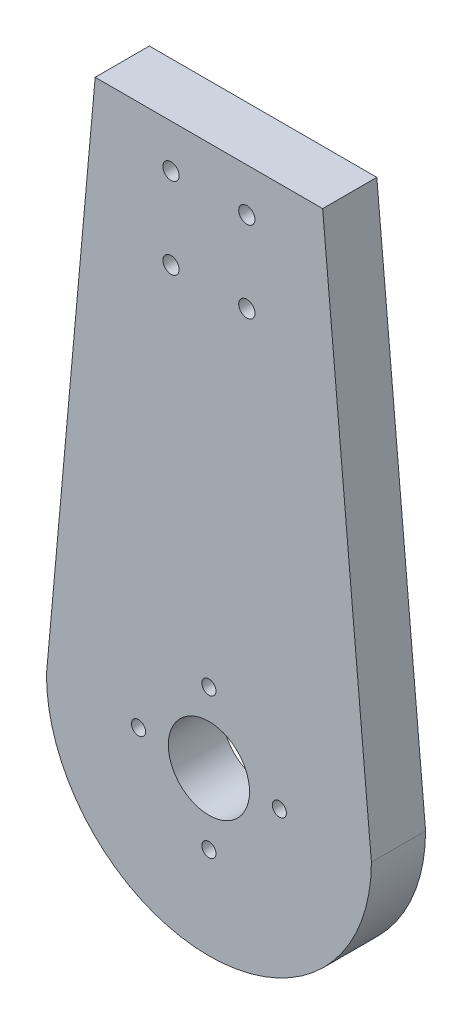
ISO-10303-21;
HEADER;
FILE_DESCRIPTION(('STEP AP214'),'2;1');
FILE_NAME('part.step','',(''),(''),'','','');
FILE_SCHEMA(('AUTOMOTIVE_DESIGN { 1 0 10303 214 1 1 1 1 }'));
ENDSEC;
DATA;
#1=APPLICATION_CONTEXT('core data for automotive mechanical design processes');
#2=APPLICATION_PROTOCOL_DEFINITION('international standard','automotive_design',2000,#1);
#3=PRODUCT_CONTEXT('',#1,'mechanical');
#4=PRODUCT('Part','Part','',(#3));
#5=PRODUCT_RELATED_PRODUCT_CATEGORY('part','',(#4));
#6=PRODUCT_DEFINITION_FORMATION('','',#4);
#7=PRODUCT_DEFINITION_CONTEXT('part definition',#1,'design');
#8=PRODUCT_DEFINITION('design','',#6,#7);
#9=PRODUCT_DEFINITION_SHAPE('','',#8);
#10=(LENGTH_UNIT() NAMED_UNIT(*) SI_UNIT(.MILLI.,.METRE.));
#11=(NAMED_UNIT(*) PLANE_ANGLE_UNIT() SI_UNIT($,.RADIAN.));
#12=(NAMED_UNIT(*) SI_UNIT($,.STERADIAN.) SOLID_ANGLE_UNIT());
#13=UNCERTAINTY_MEASURE_WITH_UNIT(LENGTH_MEASURE(1.E-05),#10,'distance_accuracy_value','');
#14=(GEOMETRIC_REPRESENTATION_CONTEXT(3) GLOBAL_UNCERTAINTY_ASSIGNED_CONTEXT((#13)) GLOBAL_UNIT_ASSIGNED_CONTEXT((#10,
#11,#12)) REPRESENTATION_CONTEXT('',''));
#15=CARTESIAN_POINT('',(0.,0.,0.));
#16=DIRECTION('',(0.,0.,1.));
#17=DIRECTION('',(1.,0.,0.));
#18=AXIS2_PLACEMENT_3D('',#15,#16,#17);
#19=CARTESIAN_POINT('',(-29.7589524848725,2.67830572363853,10.));
#20=DIRECTION('',(-0.995974438843229,0.0896376994958906,0.));
#21=DIRECTION('',(-0.0896376994958906,-0.995974438843229,0.));
#22=AXIS2_PLACEMENT_3D('',#19,#20,#21);
#23=PLANE('',#22);
#24=DIRECTION('',(0.0896376994958906,0.995974438843229,0.));
#25=VECTOR('',#24,1.);
#26=CARTESIAN_POINT('',(-29.7589524848725,2.67830572363853,0.));
#27=LINE('',#26,#25);
#28=CARTESIAN_POINT('',(-30.,0.,0.));
#29=VERTEX_POINT('',#28);
#30=CARTESIAN_POINT('',(-21.,100.,0.));
#31=VERTEX_POINT('',#30);
#32=EDGE_CURVE('E117',#29,#31,#27,.T.);
#33=ORIENTED_EDGE('',*,*,#32,.F.);
#34=DIRECTION('',(0.,0.,-1.));
#35=VECTOR('',#34,1.);
#36=CARTESIAN_POINT('',(-30.,0.,10.));
#37=LINE('',#36,#35);
#38=CARTESIAN_POINT('',(-30.,0.,10.));
#39=VERTEX_POINT('',#38);
#40=EDGE_CURVE('E11',#39,#29,#37,.T.);
#41=ORIENTED_EDGE('',*,*,#40,.F.);
#42=DIRECTION('',(0.0896376994958906,0.995974438843229,0.));
#43=VECTOR('',#42,1.);
#44=CARTESIAN_POINT('',(-29.7589524848725,2.67830572363853,10.));
#45=LINE('',#44,#43);
#46=CARTESIAN_POINT('',(-21.,100.,10.));
#47=VERTEX_POINT('',#46);
#48=EDGE_CURVE('E97',#39,#47,#45,.T.);
#49=ORIENTED_EDGE('',*,*,#48,.T.);
#50=DIRECTION('',(0.,0.,-1.));
#51=VECTOR('',#50,1.);
#52=CARTESIAN_POINT('',(-21.,100.,10.));
#53=LINE('',#52,#51);
#54=EDGE_CURVE('E65',#47,#31,#53,.T.);
#55=ORIENTED_EDGE('',*,*,#54,.T.);
#56=EDGE_LOOP('',(#33,#41,#49,#55));
#57=FACE_BOUND('',#56,.T.);
#58=ADVANCED_FACE('F48',(#57),#23,.T.);
#59=CARTESIAN_POINT('',(0.,0.,10.));
#60=DIRECTION('',(0.,0.,-1.));
#61=DIRECTION('',(-1.,0.,0.));
#62=AXIS2_PLACEMENT_3D('',#59,#60,#61);
#63=CYLINDRICAL_SURFACE('',#62,30.);
#64=CARTESIAN_POINT('',(0.,0.,0.));
#65=DIRECTION('',(0.,0.,1.));
#66=DIRECTION('',(1.,0.,0.));
#67=AXIS2_PLACEMENT_3D('',#64,#65,#66);
#68=CIRCLE('',#67,30.);
#69=CARTESIAN_POINT('',(30.,0.,0.));
#70=VERTEX_POINT('',#69);
#71=EDGE_CURVE('E104',#29,#70,#68,.T.);
#72=ORIENTED_EDGE('',*,*,#71,.T.);
#73=DIRECTION('',(0.,0.,-1.));
#74=VECTOR('',#73,1.);
#75=CARTESIAN_POINT('',(30.,0.,10.));
#76=LINE('',#75,#74);
#77=CARTESIAN_POINT('',(30.,0.,10.));
#78=VERTEX_POINT('',#77);
#79=EDGE_CURVE('E57',#78,#70,#76,.T.);
#80=ORIENTED_EDGE('',*,*,#79,.F.);
#81=CARTESIAN_POINT('',(0.,0.,10.));
#82=DIRECTION('',(0.,0.,1.));
#83=DIRECTION('',(1.,0.,0.));
#84=AXIS2_PLACEMENT_3D('',#81,#82,#83);
#85=CIRCLE('',#84,30.);
#86=EDGE_CURVE('E91',#39,#78,#85,.T.);
#87=ORIENTED_EDGE('',*,*,#86,.F.);
#88=ORIENTED_EDGE('',*,*,#40,.T.);
#89=EDGE_LOOP('',(#72,#80,#87,#88));
#90=FACE_BOUND('',#89,.T.);
#91=ADVANCED_FACE('F102',(#90),#63,.T.);
#92=CARTESIAN_POINT('',(29.7589524848725,2.67830572363853,10.));
#93=DIRECTION('',(0.995974438843229,0.0896376994958906,0.));
#94=DIRECTION('',(-0.0896376994958906,0.995974438843229,0.));
#95=AXIS2_PLACEMENT_3D('',#92,#93,#94);
#96=PLANE('',#95);
#97=DIRECTION('',(0.0896376994958906,-0.995974438843229,0.));
#98=VECTOR('',#97,1.);
#99=CARTESIAN_POINT('',(29.7589524848725,2.67830572363853,0.));
#100=LINE('',#99,#98);
#101=CARTESIAN_POINT('',(21.,100.,0.));
#102=VERTEX_POINT('',#101);
#103=EDGE_CURVE('E123',#102,#70,#100,.T.);
#104=ORIENTED_EDGE('',*,*,#103,.F.);
#105=DIRECTION('',(0.,0.,-1.));
#106=VECTOR('',#105,1.);
#107=CARTESIAN_POINT('',(21.,100.,10.));
#108=LINE('',#107,#106);
#109=CARTESIAN_POINT('',(21.,100.,10.));
#110=VERTEX_POINT('',#109);
#111=EDGE_CURVE('E78',#110,#102,#108,.T.);
#112=ORIENTED_EDGE('',*,*,#111,.F.);
#113=DIRECTION('',(0.0896376994958906,-0.995974438843229,0.));
#114=VECTOR('',#113,1.);
#115=CARTESIAN_POINT('',(29.7589524848725,2.67830572363853,10.));
#116=LINE('',#115,#114);
#117=EDGE_CURVE('E96',#110,#78,#116,.T.);
#118=ORIENTED_EDGE('',*,*,#117,.T.);
#119=ORIENTED_EDGE('',*,*,#79,.T.);
#120=EDGE_LOOP('',(#104,#112,#118,#119));
#121=FACE_BOUND('',#120,.T.);
#122=ADVANCED_FACE('F108',(#121),#96,.T.);
#123=CARTESIAN_POINT('',(0.,100.,10.));
#124=DIRECTION('',(0.,1.,0.));
#125=DIRECTION('',(0.,0.,1.));
#126=AXIS2_PLACEMENT_3D('',#123,#124,#125);
#127=PLANE('',#126);
#128=DIRECTION('',(1.,0.,0.));
#129=VECTOR('',#128,1.);
#130=CARTESIAN_POINT('',(0.,100.,0.));
#131=LINE('',#130,#129);
#132=EDGE_CURVE('E126',#31,#102,#131,.T.);
#133=ORIENTED_EDGE('',*,*,#132,.F.);
#134=ORIENTED_EDGE('',*,*,#54,.F.);
#135=DIRECTION('',(1.,0.,0.));
#136=VECTOR('',#135,1.);
#137=CARTESIAN_POINT('',(0.,100.,10.));
#138=LINE('',#137,#136);
#139=EDGE_CURVE('E110',#47,#110,#138,.T.);
#140=ORIENTED_EDGE('',*,*,#139,.T.);
#141=ORIENTED_EDGE('',*,*,#111,.T.);
#142=EDGE_LOOP('',(#133,#134,#140,#141));
#143=FACE_BOUND('',#142,.T.);
#144=ADVANCED_FACE('F218',(#143),#127,.T.);
#145=CARTESIAN_POINT('',(0.,0.,10.));
#146=DIRECTION('',(0.,0.,1.));
#147=DIRECTION('',(1.,0.,0.));
#148=AXIS2_PLACEMENT_3D('',#145,#146,#147);
#149=PLANE('',#148);
#150=CARTESIAN_POINT('',(0.,13.,10.));
#151=DIRECTION('',(0.,0.,1.));
#152=DIRECTION('',(1.,0.,0.));
#153=AXIS2_PLACEMENT_3D('',#150,#151,#152);
#154=CIRCLE('',#153,1.3);
#155=CARTESIAN_POINT('',(1.3,13.,10.));
#156=VERTEX_POINT('',#155);
#157=EDGE_CURVE('E382',#156,#156,#154,.F.);
#158=ORIENTED_EDGE('',*,*,#157,.T.);
#159=EDGE_LOOP('',(#158));
#160=FACE_BOUND('',#159,.T.);
#161=CARTESIAN_POINT('',(0.,0.,10.));
#162=DIRECTION('',(0.,0.,1.));
#163=DIRECTION('',(1.,0.,0.));
#164=AXIS2_PLACEMENT_3D('',#161,#162,#163);
#165=CIRCLE('',#164,7.5);
#166=CARTESIAN_POINT('',(7.5,0.,10.));
#167=VERTEX_POINT('',#166);
#168=EDGE_CURVE('E391',#167,#167,#165,.F.);
#169=ORIENTED_EDGE('',*,*,#168,.T.);
#170=EDGE_LOOP('',(#169));
#171=FACE_BOUND('',#170,.T.);
#172=CARTESIAN_POINT('',(13.,0.,10.));
#173=DIRECTION('',(0.,0.,1.));
#174=DIRECTION('',(1.,0.,0.));
#175=AXIS2_PLACEMENT_3D('',#172,#173,#174);
#176=CIRCLE('',#175,1.3);
#177=CARTESIAN_POINT('',(14.3,0.,10.));
#178=VERTEX_POINT('',#177);
#179=EDGE_CURVE('E198',#178,#178,#176,.F.);
#180=ORIENTED_EDGE('',*,*,#179,.T.);
#181=EDGE_LOOP('',(#180));
#182=FACE_BOUND('',#181,.T.);
#183=CARTESIAN_POINT('',(0.,-13.,10.));
#184=DIRECTION('',(0.,0.,1.));
#185=DIRECTION('',(1.,0.,0.));
#186=AXIS2_PLACEMENT_3D('',#183,#184,#185);
#187=CIRCLE('',#186,1.3);
#188=CARTESIAN_POINT('',(1.3,-13.,10.));
#189=VERTEX_POINT('',#188);
#190=EDGE_CURVE('E195',#189,#189,#187,.F.);
#191=ORIENTED_EDGE('',*,*,#190,.T.);
#192=EDGE_LOOP('',(#191));
#193=FACE_BOUND('',#192,.T.);
#194=CARTESIAN_POINT('',(-13.,0.,10.));
#195=DIRECTION('',(0.,0.,1.));
#196=DIRECTION('',(1.,0.,0.));
#197=AXIS2_PLACEMENT_3D('',#194,#195,#196);
#198=CIRCLE('',#197,1.30000000000004);
#199=CARTESIAN_POINT('',(-11.7,0.,10.));
#200=VERTEX_POINT('',#199);
#201=EDGE_CURVE('E160',#200,#200,#198,.F.);
#202=ORIENTED_EDGE('',*,*,#201,.T.);
#203=EDGE_LOOP('',(#202));
#204=FACE_BOUND('',#203,.T.);
#205=CARTESIAN_POINT('',(-7.,92.,10.));
#206=DIRECTION('',(0.,0.,1.));
#207=DIRECTION('',(1.,0.,0.));
#208=AXIS2_PLACEMENT_3D('',#205,#206,#207);
#209=CIRCLE('',#208,1.5);
#210=CARTESIAN_POINT('',(-5.5,92.,10.));
#211=VERTEX_POINT('',#210);
#212=EDGE_CURVE('E183',#211,#211,#209,.F.);
#213=ORIENTED_EDGE('',*,*,#212,.T.);
#214=EDGE_LOOP('',(#213));
#215=FACE_BOUND('',#214,.T.);
#216=CARTESIAN_POINT('',(7.,77.,10.));
#217=DIRECTION('',(0.,0.,1.));
#218=DIRECTION('',(1.,0.,0.));
#219=AXIS2_PLACEMENT_3D('',#216,#217,#218);
#220=CIRCLE('',#219,1.5);
#221=CARTESIAN_POINT('',(8.5,77.,10.));
#222=VERTEX_POINT('',#221);
#223=EDGE_CURVE('E153',#222,#222,#220,.F.);
#224=ORIENTED_EDGE('',*,*,#223,.T.);
#225=EDGE_LOOP('',(#224));
#226=FACE_BOUND('',#225,.T.);
#227=CARTESIAN_POINT('',(7.,92.,10.));
#228=DIRECTION('',(0.,0.,1.));
#229=DIRECTION('',(1.,0.,0.));
#230=AXIS2_PLACEMENT_3D('',#227,#228,#229);
#231=CIRCLE('',#230,1.5);
#232=CARTESIAN_POINT('',(8.5,92.,10.));
#233=VERTEX_POINT('',#232);
#234=EDGE_CURVE('E146',#233,#233,#231,.F.);
#235=ORIENTED_EDGE('',*,*,#234,.T.);
#236=EDGE_LOOP('',(#235));
#237=FACE_BOUND('',#236,.T.);
#238=CARTESIAN_POINT('',(-7.,77.,10.));
#239=DIRECTION('',(0.,0.,1.));
#240=DIRECTION('',(1.,0.,0.));
#241=AXIS2_PLACEMENT_3D('',#238,#239,#240);
#242=CIRCLE('',#241,1.5);
#243=CARTESIAN_POINT('',(-5.5,77.,10.));
#244=VERTEX_POINT('',#243);
#245=EDGE_CURVE('E170',#244,#244,#242,.F.);
#246=ORIENTED_EDGE('',*,*,#245,.T.);
#247=EDGE_LOOP('',(#246));
#248=FACE_BOUND('',#247,.T.);
#249=ORIENTED_EDGE('',*,*,#48,.F.);
#250=ORIENTED_EDGE('',*,*,#86,.T.);
#251=ORIENTED_EDGE('',*,*,#117,.F.);
#252=ORIENTED_EDGE('',*,*,#139,.F.);
#253=EDGE_LOOP('',(#249,#250,#251,#252));
#254=FACE_BOUND('',#253,.T.);
#255=ADVANCED_FACE('F93',(#160,#171,#182,#193,#204,#215,#226,#237,#248,#254),#149,.T.);
#256=CARTESIAN_POINT('',(0.,0.,0.));
#257=DIRECTION('',(0.,0.,1.));
#258=DIRECTION('',(1.,0.,0.));
#259=AXIS2_PLACEMENT_3D('',#256,#257,#258);
#260=PLANE('',#259);
#261=CARTESIAN_POINT('',(0.,13.,0.));
#262=DIRECTION('',(0.,0.,-1.));
#263=DIRECTION('',(-1.,0.,0.));
#264=AXIS2_PLACEMENT_3D('',#261,#262,#263);
#265=CIRCLE('',#264,1.3);
#266=CARTESIAN_POINT('',(-1.3,13.,0.));
#267=VERTEX_POINT('',#266);
#268=EDGE_CURVE('E143',#267,#267,#265,.T.);
#269=ORIENTED_EDGE('',*,*,#268,.F.);
#270=EDGE_LOOP('',(#269));
#271=FACE_BOUND('',#270,.T.);
#272=CARTESIAN_POINT('',(0.,0.,0.));
#273=DIRECTION('',(0.,0.,-1.));
#274=DIRECTION('',(-1.,0.,0.));
#275=AXIS2_PLACEMENT_3D('',#272,#273,#274);
#276=CIRCLE('',#275,7.5);
#277=CARTESIAN_POINT('',(-7.5,0.,0.));
#278=VERTEX_POINT('',#277);
#279=EDGE_CURVE('E203',#278,#278,#276,.T.);
#280=ORIENTED_EDGE('',*,*,#279,.F.);
#281=EDGE_LOOP('',(#280));
#282=FACE_BOUND('',#281,.T.);
#283=CARTESIAN_POINT('',(13.,0.,0.));
#284=DIRECTION('',(0.,0.,-1.));
#285=DIRECTION('',(-1.,0.,0.));
#286=AXIS2_PLACEMENT_3D('',#283,#284,#285);
#287=CIRCLE('',#286,1.3);
#288=CARTESIAN_POINT('',(11.7,0.,0.));
#289=VERTEX_POINT('',#288);
#290=EDGE_CURVE('E202',#289,#289,#287,.T.);
#291=ORIENTED_EDGE('',*,*,#290,.F.);
#292=EDGE_LOOP('',(#291));
#293=FACE_BOUND('',#292,.T.);
#294=CARTESIAN_POINT('',(0.,-13.,0.));
#295=DIRECTION('',(0.,0.,-1.));
#296=DIRECTION('',(-1.,0.,0.));
#297=AXIS2_PLACEMENT_3D('',#294,#295,#296);
#298=CIRCLE('',#297,1.3);
#299=CARTESIAN_POINT('',(-1.3,-13.,0.));
#300=VERTEX_POINT('',#299);
#301=EDGE_CURVE('E164',#300,#300,#298,.T.);
#302=ORIENTED_EDGE('',*,*,#301,.F.);
#303=EDGE_LOOP('',(#302));
#304=FACE_BOUND('',#303,.T.);
#305=CARTESIAN_POINT('',(-13.,0.,0.));
#306=DIRECTION('',(0.,0.,-1.));
#307=DIRECTION('',(-1.,0.,0.));
#308=AXIS2_PLACEMENT_3D('',#305,#306,#307);
#309=CIRCLE('',#308,1.30000000000004);
#310=CARTESIAN_POINT('',(-14.3,0.,0.));
#311=VERTEX_POINT('',#310);
#312=EDGE_CURVE('E163',#311,#311,#309,.T.);
#313=ORIENTED_EDGE('',*,*,#312,.F.);
#314=EDGE_LOOP('',(#313));
#315=FACE_BOUND('',#314,.T.);
#316=CARTESIAN_POINT('',(-7.,92.,0.));
#317=DIRECTION('',(0.,0.,-1.));
#318=DIRECTION('',(-1.,0.,0.));
#319=AXIS2_PLACEMENT_3D('',#316,#317,#318);
#320=CIRCLE('',#319,1.5);
#321=CARTESIAN_POINT('',(-8.5,92.,0.));
#322=VERTEX_POINT('',#321);
#323=EDGE_CURVE('E176',#322,#322,#320,.T.);
#324=ORIENTED_EDGE('',*,*,#323,.F.);
#325=EDGE_LOOP('',(#324));
#326=FACE_BOUND('',#325,.T.);
#327=CARTESIAN_POINT('',(7.,77.,0.));
#328=DIRECTION('',(0.,0.,-1.));
#329=DIRECTION('',(-1.,0.,0.));
#330=AXIS2_PLACEMENT_3D('',#327,#328,#329);
#331=CIRCLE('',#330,1.5);
#332=CARTESIAN_POINT('',(5.5,77.,0.));
#333=VERTEX_POINT('',#332);
#334=EDGE_CURVE('E157',#333,#333,#331,.T.);
#335=ORIENTED_EDGE('',*,*,#334,.F.);
#336=EDGE_LOOP('',(#335));
#337=FACE_BOUND('',#336,.T.);
#338=CARTESIAN_POINT('',(7.,92.,0.));
#339=DIRECTION('',(0.,0.,-1.));
#340=DIRECTION('',(-1.,0.,0.));
#341=AXIS2_PLACEMENT_3D('',#338,#339,#340);
#342=CIRCLE('',#341,1.5);
#343=CARTESIAN_POINT('',(5.5,92.,0.));
#344=VERTEX_POINT('',#343);
#345=EDGE_CURVE('E149',#344,#344,#342,.T.);
#346=ORIENTED_EDGE('',*,*,#345,.F.);
#347=EDGE_LOOP('',(#346));
#348=FACE_BOUND('',#347,.T.);
#349=CARTESIAN_POINT('',(-7.,77.,0.));
#350=DIRECTION('',(0.,0.,-1.));
#351=DIRECTION('',(-1.,0.,0.));
#352=AXIS2_PLACEMENT_3D('',#349,#350,#351);
#353=CIRCLE('',#352,1.5);
#354=CARTESIAN_POINT('',(-8.5,77.,0.));
#355=VERTEX_POINT('',#354);
#356=EDGE_CURVE('E120',#355,#355,#353,.T.);
#357=ORIENTED_EDGE('',*,*,#356,.F.);
#358=EDGE_LOOP('',(#357));
#359=FACE_BOUND('',#358,.T.);
#360=ORIENTED_EDGE('',*,*,#32,.T.);
#361=ORIENTED_EDGE('',*,*,#132,.T.);
#362=ORIENTED_EDGE('',*,*,#103,.T.);
#363=ORIENTED_EDGE('',*,*,#71,.F.);
#364=EDGE_LOOP('',(#360,#361,#362,#363));
#365=FACE_BOUND('',#364,.T.);
#366=ADVANCED_FACE('F225',(#271,#282,#293,#304,#315,#326,#337,#348,#359,#365),#260,.F.);
#367=CARTESIAN_POINT('',(-7.,77.,10.001));
#368=DIRECTION('',(0.,0.,-1.));
#369=DIRECTION('',(-1.,0.,0.));
#370=AXIS2_PLACEMENT_3D('',#367,#368,#369);
#371=CYLINDRICAL_SURFACE('',#370,1.5);
#372=ORIENTED_EDGE('',*,*,#245,.F.);
#373=EDGE_LOOP('',(#372));
#374=FACE_BOUND('',#373,.T.);
#375=ORIENTED_EDGE('',*,*,#356,.T.);
#376=EDGE_LOOP('',(#375));
#377=FACE_BOUND('',#376,.T.);
#378=ADVANCED_FACE('F256',(#374,#377),#371,.F.);
#379=CARTESIAN_POINT('',(7.,92.,10.001));
#380=DIRECTION('',(0.,0.,-1.));
#381=DIRECTION('',(-1.,0.,0.));
#382=AXIS2_PLACEMENT_3D('',#379,#380,#381);
#383=CYLINDRICAL_SURFACE('',#382,1.5);
#384=ORIENTED_EDGE('',*,*,#234,.F.);
#385=EDGE_LOOP('',(#384));
#386=FACE_BOUND('',#385,.T.);
#387=ORIENTED_EDGE('',*,*,#345,.T.);
#388=EDGE_LOOP('',(#387));
#389=FACE_BOUND('',#388,.T.);
#390=ADVANCED_FACE('F264',(#386,#389),#383,.F.);
#391=CARTESIAN_POINT('',(7.,77.,10.001));
#392=DIRECTION('',(0.,0.,-1.));
#393=DIRECTION('',(-1.,0.,0.));
#394=AXIS2_PLACEMENT_3D('',#391,#392,#393);
#395=CYLINDRICAL_SURFACE('',#394,1.5);
#396=ORIENTED_EDGE('',*,*,#223,.F.);
#397=EDGE_LOOP('',(#396));
#398=FACE_BOUND('',#397,.T.);
#399=ORIENTED_EDGE('',*,*,#334,.T.);
#400=EDGE_LOOP('',(#399));
#401=FACE_BOUND('',#400,.T.);
#402=ADVANCED_FACE('F273',(#398,#401),#395,.F.);
#403=CARTESIAN_POINT('',(-7.,92.,10.001));
#404=DIRECTION('',(0.,0.,-1.));
#405=DIRECTION('',(-1.,0.,0.));
#406=AXIS2_PLACEMENT_3D('',#403,#404,#405);
#407=CYLINDRICAL_SURFACE('',#406,1.5);
#408=ORIENTED_EDGE('',*,*,#212,.F.);
#409=EDGE_LOOP('',(#408));
#410=FACE_BOUND('',#409,.T.);
#411=ORIENTED_EDGE('',*,*,#323,.T.);
#412=EDGE_LOOP('',(#411));
#413=FACE_BOUND('',#412,.T.);
#414=ADVANCED_FACE('F282',(#410,#413),#407,.F.);
#415=CARTESIAN_POINT('',(-13.,0.,10.001));
#416=DIRECTION('',(0.,0.,-1.));
#417=DIRECTION('',(-1.,0.,0.));
#418=AXIS2_PLACEMENT_3D('',#415,#416,#417);
#419=CYLINDRICAL_SURFACE('',#418,1.30000000000004);
#420=ORIENTED_EDGE('',*,*,#201,.F.);
#421=EDGE_LOOP('',(#420));
#422=FACE_BOUND('',#421,.T.);
#423=ORIENTED_EDGE('',*,*,#312,.T.);
#424=EDGE_LOOP('',(#423));
#425=FACE_BOUND('',#424,.T.);
#426=ADVANCED_FACE('F290',(#422,#425),#419,.F.);
#427=CARTESIAN_POINT('',(0.,-13.,10.001));
#428=DIRECTION('',(0.,0.,-1.));
#429=DIRECTION('',(-1.,0.,0.));
#430=AXIS2_PLACEMENT_3D('',#427,#428,#429);
#431=CYLINDRICAL_SURFACE('',#430,1.3);
#432=ORIENTED_EDGE('',*,*,#190,.F.);
#433=EDGE_LOOP('',(#432));
#434=FACE_BOUND('',#433,.T.);
#435=ORIENTED_EDGE('',*,*,#301,.T.);
#436=EDGE_LOOP('',(#435));
#437=FACE_BOUND('',#436,.T.);
#438=ADVANCED_FACE('F298',(#434,#437),#431,.F.);
#439=CARTESIAN_POINT('',(13.,0.,10.001));
#440=DIRECTION('',(0.,0.,-1.));
#441=DIRECTION('',(-1.,0.,0.));
#442=AXIS2_PLACEMENT_3D('',#439,#440,#441);
#443=CYLINDRICAL_SURFACE('',#442,1.3);
#444=ORIENTED_EDGE('',*,*,#179,.F.);
#445=EDGE_LOOP('',(#444));
#446=FACE_BOUND('',#445,.T.);
#447=ORIENTED_EDGE('',*,*,#290,.T.);
#448=EDGE_LOOP('',(#447));
#449=FACE_BOUND('',#448,.T.);
#450=ADVANCED_FACE('F307',(#446,#449),#443,.F.);
#451=CARTESIAN_POINT('',(0.,0.,10.001));
#452=DIRECTION('',(0.,0.,-1.));
#453=DIRECTION('',(-1.,0.,0.));
#454=AXIS2_PLACEMENT_3D('',#451,#452,#453);
#455=CYLINDRICAL_SURFACE('',#454,7.5);
#456=ORIENTED_EDGE('',*,*,#168,.F.);
#457=EDGE_LOOP('',(#456));
#458=FACE_BOUND('',#457,.T.);
#459=ORIENTED_EDGE('',*,*,#279,.T.);
#460=EDGE_LOOP('',(#459));
#461=FACE_BOUND('',#460,.T.);
#462=ADVANCED_FACE('F316',(#458,#461),#455,.F.);
#463=CARTESIAN_POINT('',(0.,13.,10.001));
#464=DIRECTION('',(0.,0.,-1.));
#465=DIRECTION('',(-1.,0.,0.));
#466=AXIS2_PLACEMENT_3D('',#463,#464,#465);
#467=CYLINDRICAL_SURFACE('',#466,1.3);
#468=ORIENTED_EDGE('',*,*,#157,.F.);
#469=EDGE_LOOP('',(#468));
#470=FACE_BOUND('',#469,.T.);
#471=ORIENTED_EDGE('',*,*,#268,.T.);
#472=EDGE_LOOP('',(#471));
#473=FACE_BOUND('',#472,.T.);
#474=ADVANCED_FACE('F325',(#470,#473),#467,.F.);
#475=CLOSED_SHELL('',(#58,#91,#122,#144,#255,#366,#378,#390,#402,#414,#426,#438,#450,#462,#474));
#476=MANIFOLD_SOLID_BREP('B2',#475);
#477=ADVANCED_BREP_SHAPE_REPRESENTATION('',(#18,#476),#14);
#478=SHAPE_DEFINITION_REPRESENTATION(#9,#477);
ENDSEC;
END-ISO-10303-21;
